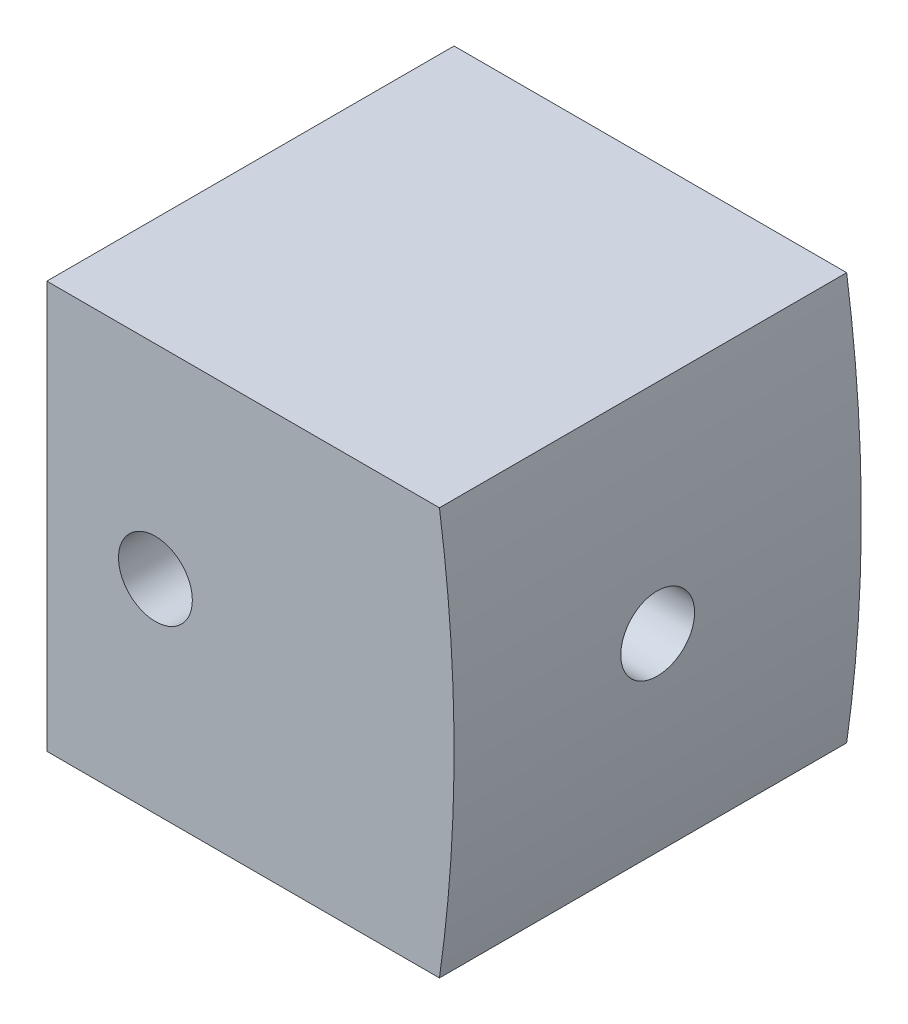
ISO-10303-21;
HEADER;
FILE_DESCRIPTION(('STEP AP214'),'2;1');
FILE_NAME('part.step','',(''),(''),'','','');
FILE_SCHEMA(('AUTOMOTIVE_DESIGN { 1 0 10303 214 1 1 1 1 }'));
ENDSEC;
DATA;
#1=APPLICATION_CONTEXT('core data for automotive mechanical design processes');
#2=APPLICATION_PROTOCOL_DEFINITION('international standard','automotive_design',2000,#1);
#3=PRODUCT_CONTEXT('',#1,'mechanical');
#4=PRODUCT('Part','Part','',(#3));
#5=PRODUCT_RELATED_PRODUCT_CATEGORY('part','',(#4));
#6=PRODUCT_DEFINITION_FORMATION('','',#4);
#7=PRODUCT_DEFINITION_CONTEXT('part definition',#1,'design');
#8=PRODUCT_DEFINITION('design','',#6,#7);
#9=PRODUCT_DEFINITION_SHAPE('','',#8);
#10=(LENGTH_UNIT() NAMED_UNIT(*) SI_UNIT(.MILLI.,.METRE.));
#11=(NAMED_UNIT(*) PLANE_ANGLE_UNIT() SI_UNIT($,.RADIAN.));
#12=(NAMED_UNIT(*) SI_UNIT($,.STERADIAN.) SOLID_ANGLE_UNIT());
#13=UNCERTAINTY_MEASURE_WITH_UNIT(LENGTH_MEASURE(1.E-05),#10,'distance_accuracy_value','');
#14=(GEOMETRIC_REPRESENTATION_CONTEXT(3) GLOBAL_UNCERTAINTY_ASSIGNED_CONTEXT((#13)) GLOBAL_UNIT_ASSIGNED_CONTEXT((#10,
#11,#12)) REPRESENTATION_CONTEXT('',''));
#15=CARTESIAN_POINT('',(0.,0.,0.));
#16=DIRECTION('',(0.,0.,1.));
#17=DIRECTION('',(1.,0.,0.));
#18=AXIS2_PLACEMENT_3D('',#15,#16,#17);
#19=CARTESIAN_POINT('',(-9.525,0.,9.525));
#20=DIRECTION('',(-1.,0.,0.));
#21=DIRECTION('',(0.,0.,1.));
#22=AXIS2_PLACEMENT_3D('',#19,#20,#21);
#23=CYLINDRICAL_SURFACE('',#22,1.72719999999999);
#24=CARTESIAN_POINT('',(-9.525,0.,9.525));
#25=DIRECTION('',(-1.,0.,0.));
#26=DIRECTION('',(0.,0.,1.));
#27=AXIS2_PLACEMENT_3D('',#24,#25,#26);
#28=CIRCLE('',#27,1.72719999999999);
#29=CARTESIAN_POINT('',(-9.525,0.,11.2522));
#30=VERTEX_POINT('',#29);
#31=EDGE_CURVE('E170',#30,#30,#28,.T.);
#32=ORIENTED_EDGE('',*,*,#31,.T.);
#33=EDGE_LOOP('',(#32));
#34=FACE_BOUND('',#33,.T.);
#35=CARTESIAN_POINT('',(-4.445,0.,9.525));
#36=DIRECTION('',(-0.707106781186547,0.,-0.707106781186547));
#37=DIRECTION('',(-0.707106781186547,0.,0.707106781186547));
#38=AXIS2_PLACEMENT_3D('',#35,#36,#37);
#39=ELLIPSE('',#38,2.4426296649308,1.72719999999999);
#40=CARTESIAN_POINT('',(-4.445,1.72719999999999,9.525));
#41=VERTEX_POINT('',#40);
#42=CARTESIAN_POINT('',(-4.445,-1.72719999999999,9.525));
#43=VERTEX_POINT('',#42);
#44=EDGE_CURVE('E44',#41,#43,#39,.F.);
#45=ORIENTED_EDGE('',*,*,#44,.T.);
#46=CARTESIAN_POINT('',(-4.445,0.,9.525));
#47=DIRECTION('',(-0.707106781186547,0.,0.707106781186547));
#48=DIRECTION('',(-0.707106781186547,0.,-0.707106781186547));
#49=AXIS2_PLACEMENT_3D('',#46,#47,#48);
#50=ELLIPSE('',#49,2.4426296649308,1.72719999999999);
#51=EDGE_CURVE('E11',#43,#41,#50,.F.);
#52=ORIENTED_EDGE('',*,*,#51,.T.);
#53=EDGE_LOOP('',(#45,#52));
#54=FACE_BOUND('',#53,.T.);
#55=ADVANCED_FACE('F31',(#34,#54),#23,.F.);
#56=CARTESIAN_POINT('',(-57.15,0.,84.1069598552339));
#57=DIRECTION('',(0.,0.,-1.));
#58=DIRECTION('',(-1.,0.,0.));
#59=AXIS2_PLACEMENT_3D('',#56,#57,#58);
#60=CYLINDRICAL_SURFACE('',#59,66.675);
#61=CARTESIAN_POINT('',(9.525,0.,7.79780000000001));
#62=CARTESIAN_POINT('',(9.5249997271463,-0.096919026527518,7.79780401584252));
#63=CARTESIAN_POINT('',(9.52478626524063,-0.193969002963632,7.80599089557251));
#64=CARTESIAN_POINT('',(9.52395488633022,-0.38545609424327,7.83855083494033));
#65=CARTESIAN_POINT('',(9.52333610470426,-0.479887172625967,7.86295849810765));
#66=CARTESIAN_POINT('',(9.52176410965185,-0.663243979803649,7.9272668859244));
#67=CARTESIAN_POINT('',(9.52081117860507,-0.752174282722503,7.96715453193407));
#68=CARTESIAN_POINT('',(9.51867863219222,-0.922029105703944,8.06126932741671));
#69=CARTESIAN_POINT('',(9.51749912369497,-1.00295737290155,8.11548972114059));
#70=CARTESIAN_POINT('',(9.51504547340202,-1.15459941018497,8.23676527820526));
#71=CARTESIAN_POINT('',(9.5137712936209,-1.22530904632216,8.30382561058093));
#72=CARTESIAN_POINT('',(9.51127219994384,-1.35447339710308,8.44887120857517));
#73=CARTESIAN_POINT('',(9.5100472903271,-1.41292704913954,8.52685742050244));
#74=CARTESIAN_POINT('',(9.50778483740791,-1.51591858749009,8.69154693720306));
#75=CARTESIAN_POINT('',(9.50674731339763,-1.56045504131022,8.77825113810374));
#76=CARTESIAN_POINT('',(9.50497684406234,-1.63433793709756,8.95790823795522));
#77=CARTESIAN_POINT('',(9.50424389502836,-1.6636845640409,9.05086106079702));
#78=CARTESIAN_POINT('',(9.50316539896893,-1.70634916287136,9.24035567637849));
#79=CARTESIAN_POINT('',(9.50281976593061,-1.71967069356651,9.33689666735668));
#80=CARTESIAN_POINT('',(9.50255461410864,-1.72991789260032,9.53084542146387));
#81=CARTESIAN_POINT('',(9.50263509462856,-1.72684358773523,9.62825318317603));
#82=CARTESIAN_POINT('',(9.50321301298442,-1.70438947216201,9.82114517588286));
#83=CARTESIAN_POINT('',(9.50371034837884,-1.68501366752044,9.91662987356476));
#84=CARTESIAN_POINT('',(9.50506575691723,-1.63051243227466,10.1029917235434));
#85=CARTESIAN_POINT('',(9.50592383420965,-1.59538682055032,10.1938688228401));
#86=CARTESIAN_POINT('',(9.50790414644867,-1.51037703728569,10.3684506604803));
#87=CARTESIAN_POINT('',(9.50902642353302,-1.46049051117104,10.4521542517986));
#88=CARTESIAN_POINT('',(9.51140845283288,-1.34738135119607,10.6099926028409));
#89=CARTESIAN_POINT('',(9.51266819350677,-1.28415983654347,10.6841281647698));
#90=CARTESIAN_POINT('',(9.5151834290075,-1.14616559902246,10.8207440595046));
#91=CARTESIAN_POINT('',(9.51643892339445,-1.07139171473136,10.883223219033));
#92=CARTESIAN_POINT('',(9.51880463928992,-0.91237340947304,10.9947717052161));
#93=CARTESIAN_POINT('',(9.51991479187773,-0.828124530436558,11.0438346818698));
#94=CARTESIAN_POINT('',(9.52186476132179,-0.6525258640606,11.1271513462516));
#95=CARTESIAN_POINT('',(9.52270435036638,-0.561170172776067,11.1613925624937));
#96=CARTESIAN_POINT('',(9.5240155620405,-0.374131258654292,11.2139781989615));
#97=CARTESIAN_POINT('',(9.52448796743231,-0.278457704218404,11.2323564451719));
#98=CARTESIAN_POINT('',(9.52483410453939,-0.151813653192035,11.2457851059836));
#99=CARTESIAN_POINT('',(9.52489619656248,-0.12150426125484,11.2481890068486));
#100=CARTESIAN_POINT('',(9.52497918709485,-0.0608008759945975,11.2513970838197));
#101=CARTESIAN_POINT('',(9.52500008560374,-0.030406882670709,11.25220125991));
#102=CARTESIAN_POINT('',(9.52499972714631,0.0969190265275162,11.2521959841575));
#103=CARTESIAN_POINT('',(9.52478626524063,0.19396900296363,11.2440091044275));
#104=CARTESIAN_POINT('',(9.52395488633022,0.385456094243269,11.2114491650597));
#105=CARTESIAN_POINT('',(9.52333610470426,0.479887172625966,11.1870415018924));
#106=CARTESIAN_POINT('',(9.52176410965185,0.66324397980365,11.1227331140756));
#107=CARTESIAN_POINT('',(9.52081117860506,0.752174282722503,11.0828454680659));
#108=CARTESIAN_POINT('',(9.51867863219221,0.922029105703945,10.9887306725833));
#109=CARTESIAN_POINT('',(9.51749912369497,1.00295737290155,10.9345102788594));
#110=CARTESIAN_POINT('',(9.51504547340202,1.15459941018497,10.8132347217947));
#111=CARTESIAN_POINT('',(9.51377129362089,1.22530904632216,10.7461743894191));
#112=CARTESIAN_POINT('',(9.51127219994383,1.35447339710308,10.6011287914248));
#113=CARTESIAN_POINT('',(9.5100472903271,1.41292704913954,10.5231425794976));
#114=CARTESIAN_POINT('',(9.50778483740791,1.51591858749009,10.358453062797));
#115=CARTESIAN_POINT('',(9.50674731339763,1.56045504131022,10.2717488618963));
#116=CARTESIAN_POINT('',(9.50497684406235,1.63433793709756,10.0920917620448));
#117=CARTESIAN_POINT('',(9.50424389502836,1.6636845640409,9.99913893920298));
#118=CARTESIAN_POINT('',(9.50316539896893,1.70634916287136,9.80964432362152));
#119=CARTESIAN_POINT('',(9.50281976593061,1.71967069356651,9.71310333264333));
#120=CARTESIAN_POINT('',(9.50255461410863,1.72991789260032,9.51915457853613));
#121=CARTESIAN_POINT('',(9.50263509462856,1.72684358773523,9.42174681682398));
#122=CARTESIAN_POINT('',(9.50321301298442,1.70438947216201,9.22885482411714));
#123=CARTESIAN_POINT('',(9.50371034837884,1.68501366752044,9.13337012643525));
#124=CARTESIAN_POINT('',(9.50506575691723,1.63051243227466,8.94700827645663));
#125=CARTESIAN_POINT('',(9.50592383420965,1.59538682055032,8.85613117715989));
#126=CARTESIAN_POINT('',(9.50790414644867,1.51037703728568,8.68154933951973));
#127=CARTESIAN_POINT('',(9.50902642353303,1.46049051117103,8.59784574820137));
#128=CARTESIAN_POINT('',(9.51140845283289,1.34738135119607,8.44000739715914));
#129=CARTESIAN_POINT('',(9.51266819350677,1.28415983654347,8.36587183523019));
#130=CARTESIAN_POINT('',(9.5151834290075,1.14616559902246,8.22925594049541));
#131=CARTESIAN_POINT('',(9.51643892339446,1.07139171473135,8.16677678096699));
#132=CARTESIAN_POINT('',(9.51880463928992,0.912373409473034,8.05522829478391));
#133=CARTESIAN_POINT('',(9.51991479187772,0.828124530436552,8.00616531813018));
#134=CARTESIAN_POINT('',(9.52186476132178,0.652525864060593,7.92284865374844));
#135=CARTESIAN_POINT('',(9.52270435036636,0.561170172776059,7.88860743750635));
#136=CARTESIAN_POINT('',(9.5240155620405,0.374131258654284,7.83602180103849));
#137=CARTESIAN_POINT('',(9.52448796743231,0.278457704218396,7.81764355482807));
#138=CARTESIAN_POINT('',(9.52483410453939,0.151813653192028,7.80421489401642));
#139=CARTESIAN_POINT('',(9.52489619656247,0.121504261254833,7.80181099315143));
#140=CARTESIAN_POINT('',(9.52497918709485,0.0608008759945933,7.79860291618026));
#141=CARTESIAN_POINT('',(9.52500008560373,0.0304068826707059,7.79779874009));
#142=CARTESIAN_POINT('',(9.525,0.,7.79780000000001));
#143=B_SPLINE_CURVE_WITH_KNOTS('',3,(#61,#62,#63,#64,#65,#66,#67,#68,#69,#70,#71,#72,#73,#74,
#75,#76,#77,#78,#79,#80,#81,#82,#83,#84,#85,#86,#87,#88,#89,#90,#91,#92,#93,#94,#95,#96,#97,#98,
#99,#100,#101,#102,#103,#104,#105,#106,#107,#108,#109,#110,#111,#112,#113,#114,#115,#116,#117,
#118,#119,#120,#121,#122,#123,#124,#125,#126,#127,#128,#129,#130,#131,#132,#133,#134,#135,#136,
#137,#138,#139,#140,#141,#142),.UNSPECIFIED.,.T.,.F.,(4,2,2,2,2,2,2,2,2,2,2,2,2,2,2,2,2,2,2,2,2,
2,2,2,2,2,2,2,2,2,2,2,2,2,2,2,2,2,2,2,4),(0.,0.290641425486586,0.581904870359256,
0.872922768079454,1.16380373817944,1.4548020567626,1.7458255947962,2.03687907795566,
2.32792901668943,2.61891430793689,2.90989912361762,3.20081245114229,3.49172912420721,
3.78269222763107,4.07363092018563,4.36459888144921,4.65570432304464,4.94705423582523,
5.23778133215426,5.32896569453136,5.42015005781537,5.71079148330196,6.00205492817463,
6.29307282589483,6.58395379599481,6.87495211457798,7.16597565261158,7.45702913577103,
7.7480790745048,8.03906436575227,8.33004918143299,8.62096250895767,8.91187918202258,
9.20284228544644,9.493780978001,9.78474893926458,10.07585438086,10.3672042936406,
10.6579313899696,10.7491157523467,10.8403001156307),.UNSPECIFIED.);
#144=CARTESIAN_POINT('',(9.525,0.,7.79780000000001));
#145=VERTEX_POINT('',#144);
#146=EDGE_CURVE('E86',#145,#145,#143,.T.);
#147=ORIENTED_EDGE('',*,*,#146,.T.);
#148=EDGE_LOOP('',(#147));
#149=FACE_BOUND('',#148,.T.);
#150=DIRECTION('',(0.,0.,-1.));
#151=VECTOR('',#150,1.);
#152=CARTESIAN_POINT('',(8.84113576837422,9.525,84.1069598552339));
#153=LINE('',#152,#151);
#154=CARTESIAN_POINT('',(8.84113576837422,9.525,19.05));
#155=VERTEX_POINT('',#154);
#156=CARTESIAN_POINT('',(8.84113576837422,9.525,0.));
#157=VERTEX_POINT('',#156);
#158=EDGE_CURVE('E151',#155,#157,#153,.T.);
#159=ORIENTED_EDGE('',*,*,#158,.F.);
#160=CARTESIAN_POINT('',(-57.15,0.,19.05));
#161=DIRECTION('',(0.,0.,-1.));
#162=DIRECTION('',(-1.,0.,0.));
#163=AXIS2_PLACEMENT_3D('',#160,#161,#162);
#164=CIRCLE('',#163,66.675);
#165=CARTESIAN_POINT('',(8.84113576837423,-9.52499999999997,19.05));
#166=VERTEX_POINT('',#165);
#167=EDGE_CURVE('E156',#155,#166,#164,.T.);
#168=ORIENTED_EDGE('',*,*,#167,.T.);
#169=DIRECTION('',(0.,0.,-1.));
#170=VECTOR('',#169,1.);
#171=CARTESIAN_POINT('',(8.84113576837423,-9.52499999999997,84.1069598552339));
#172=LINE('',#171,#170);
#173=CARTESIAN_POINT('',(8.84113576837423,-9.525,0.));
#174=VERTEX_POINT('',#173);
#175=EDGE_CURVE('E145',#166,#174,#172,.T.);
#176=ORIENTED_EDGE('',*,*,#175,.T.);
#177=CARTESIAN_POINT('',(-57.15,0.,0.));
#178=DIRECTION('',(0.,0.,-1.));
#179=DIRECTION('',(-1.,0.,0.));
#180=AXIS2_PLACEMENT_3D('',#177,#178,#179);
#181=CIRCLE('',#180,66.675);
#182=EDGE_CURVE('E52',#157,#174,#181,.T.);
#183=ORIENTED_EDGE('',*,*,#182,.F.);
#184=EDGE_LOOP('',(#159,#168,#176,#183));
#185=FACE_BOUND('',#184,.T.);
#186=ADVANCED_FACE('F101',(#149,#185),#60,.T.);
#187=CARTESIAN_POINT('',(-9.525,9.525,19.05));
#188=DIRECTION('',(0.,-1.,0.));
#189=DIRECTION('',(0.,0.,-1.));
#190=AXIS2_PLACEMENT_3D('',#187,#188,#189);
#191=PLANE('',#190);
#192=ORIENTED_EDGE('',*,*,#158,.T.);
#193=DIRECTION('',(-1.,0.,0.));
#194=VECTOR('',#193,1.);
#195=CARTESIAN_POINT('',(-9.525,9.525,0.));
#196=LINE('',#195,#194);
#197=CARTESIAN_POINT('',(-9.525,9.525,0.));
#198=VERTEX_POINT('',#197);
#199=EDGE_CURVE('E167',#157,#198,#196,.T.);
#200=ORIENTED_EDGE('',*,*,#199,.T.);
#201=DIRECTION('',(0.,0.,-1.));
#202=VECTOR('',#201,1.);
#203=CARTESIAN_POINT('',(-9.525,9.525,19.05));
#204=LINE('',#203,#202);
#205=CARTESIAN_POINT('',(-9.525,9.525,19.05));
#206=VERTEX_POINT('',#205);
#207=EDGE_CURVE('E97',#206,#198,#204,.T.);
#208=ORIENTED_EDGE('',*,*,#207,.F.);
#209=DIRECTION('',(-1.,0.,0.));
#210=VECTOR('',#209,1.);
#211=CARTESIAN_POINT('',(-9.525,9.525,19.05));
#212=LINE('',#211,#210);
#213=EDGE_CURVE('E163',#155,#206,#212,.T.);
#214=ORIENTED_EDGE('',*,*,#213,.F.);
#215=EDGE_LOOP('',(#192,#200,#208,#214));
#216=FACE_BOUND('',#215,.T.);
#217=ADVANCED_FACE('F33',(#216),#191,.F.);
#218=CARTESIAN_POINT('',(-9.525,-9.525,19.05));
#219=DIRECTION('',(0.,1.,0.));
#220=DIRECTION('',(0.,0.,1.));
#221=AXIS2_PLACEMENT_3D('',#218,#219,#220);
#222=PLANE('',#221);
#223=ORIENTED_EDGE('',*,*,#175,.F.);
#224=DIRECTION('',(1.,0.,0.));
#225=VECTOR('',#224,1.);
#226=CARTESIAN_POINT('',(-9.525,-9.525,19.05));
#227=LINE('',#226,#225);
#228=CARTESIAN_POINT('',(-9.525,-9.525,19.05));
#229=VERTEX_POINT('',#228);
#230=EDGE_CURVE('E148',#229,#166,#227,.T.);
#231=ORIENTED_EDGE('',*,*,#230,.F.);
#232=DIRECTION('',(0.,0.,-1.));
#233=VECTOR('',#232,1.);
#234=CARTESIAN_POINT('',(-9.525,-9.525,19.05));
#235=LINE('',#234,#233);
#236=CARTESIAN_POINT('',(-9.525,-9.525,0.));
#237=VERTEX_POINT('',#236);
#238=EDGE_CURVE('E161',#229,#237,#235,.T.);
#239=ORIENTED_EDGE('',*,*,#238,.T.);
#240=DIRECTION('',(1.,0.,0.));
#241=VECTOR('',#240,1.);
#242=CARTESIAN_POINT('',(-9.525,-9.525,0.));
#243=LINE('',#242,#241);
#244=EDGE_CURVE('E149',#237,#174,#243,.T.);
#245=ORIENTED_EDGE('',*,*,#244,.T.);
#246=EDGE_LOOP('',(#223,#231,#239,#245));
#247=FACE_BOUND('',#246,.T.);
#248=ADVANCED_FACE('F132',(#247),#222,.F.);
#249=CARTESIAN_POINT('',(9.525,9.525,19.05));
#250=DIRECTION('',(0.,0.,-1.));
#251=DIRECTION('',(-1.,0.,0.));
#252=AXIS2_PLACEMENT_3D('',#249,#250,#251);
#253=PLANE('',#252);
#254=CARTESIAN_POINT('',(-4.445,0.,19.05));
#255=DIRECTION('',(0.,0.,1.));
#256=DIRECTION('',(1.,0.,0.));
#257=AXIS2_PLACEMENT_3D('',#254,#255,#256);
#258=CIRCLE('',#257,1.72719999999999);
#259=CARTESIAN_POINT('',(-2.71780000000001,0.,19.05));
#260=VERTEX_POINT('',#259);
#261=EDGE_CURVE('E180',#260,#260,#258,.T.);
#262=ORIENTED_EDGE('',*,*,#261,.F.);
#263=EDGE_LOOP('',(#262));
#264=FACE_BOUND('',#263,.T.);
#265=ORIENTED_EDGE('',*,*,#167,.F.);
#266=ORIENTED_EDGE('',*,*,#213,.T.);
#267=DIRECTION('',(0.,-1.,0.));
#268=VECTOR('',#267,1.);
#269=CARTESIAN_POINT('',(-9.525,-9.525,19.05));
#270=LINE('',#269,#268);
#271=EDGE_CURVE('E159',#206,#229,#270,.T.);
#272=ORIENTED_EDGE('',*,*,#271,.T.);
#273=ORIENTED_EDGE('',*,*,#230,.T.);
#274=EDGE_LOOP('',(#265,#266,#272,#273));
#275=FACE_BOUND('',#274,.T.);
#276=ADVANCED_FACE('F126',(#264,#275),#253,.F.);
#277=CARTESIAN_POINT('',(9.525,9.525,0.));
#278=DIRECTION('',(0.,0.,-1.));
#279=DIRECTION('',(-1.,0.,0.));
#280=AXIS2_PLACEMENT_3D('',#277,#278,#279);
#281=PLANE('',#280);
#282=CARTESIAN_POINT('',(-4.445,0.,0.));
#283=DIRECTION('',(0.,0.,1.));
#284=DIRECTION('',(1.,0.,0.));
#285=AXIS2_PLACEMENT_3D('',#282,#283,#284);
#286=CIRCLE('',#285,1.7272);
#287=CARTESIAN_POINT('',(-2.7178,0.,0.));
#288=VERTEX_POINT('',#287);
#289=EDGE_CURVE('E152',#288,#288,#286,.T.);
#290=ORIENTED_EDGE('',*,*,#289,.T.);
#291=EDGE_LOOP('',(#290));
#292=FACE_BOUND('',#291,.T.);
#293=ORIENTED_EDGE('',*,*,#199,.F.);
#294=ORIENTED_EDGE('',*,*,#182,.T.);
#295=ORIENTED_EDGE('',*,*,#244,.F.);
#296=DIRECTION('',(0.,-1.,0.));
#297=VECTOR('',#296,1.);
#298=CARTESIAN_POINT('',(-9.525,-9.525,0.));
#299=LINE('',#298,#297);
#300=EDGE_CURVE('E169',#198,#237,#299,.T.);
#301=ORIENTED_EDGE('',*,*,#300,.F.);
#302=EDGE_LOOP('',(#293,#294,#295,#301));
#303=FACE_BOUND('',#302,.T.);
#304=ADVANCED_FACE('F120',(#292,#303),#281,.T.);
#305=CARTESIAN_POINT('',(-4.445,0.,9.525));
#306=DIRECTION('',(-0.707106781186547,0.,-0.707106781186547));
#307=DIRECTION('',(-0.707106781186547,0.,0.707106781186547));
#308=AXIS2_PLACEMENT_3D('',#305,#306,#307);
#309=ELLIPSE('',#308,2.4426296649308,1.72719999999999);
#310=EDGE_CURVE('E79',#41,#43,#309,.T.);
#311=ORIENTED_EDGE('',*,*,#310,.T.);
#312=CARTESIAN_POINT('',(-4.445,0.,9.525));
#313=DIRECTION('',(-0.707106781186547,0.,0.707106781186547));
#314=DIRECTION('',(-0.707106781186547,0.,-0.707106781186547));
#315=AXIS2_PLACEMENT_3D('',#312,#313,#314);
#316=ELLIPSE('',#315,2.4426296649308,1.72719999999999);
#317=EDGE_CURVE('E39',#43,#41,#316,.T.);
#318=ORIENTED_EDGE('',*,*,#317,.T.);
#319=EDGE_LOOP('',(#311,#318));
#320=FACE_BOUND('',#319,.T.);
#321=ORIENTED_EDGE('',*,*,#146,.F.);
#322=EDGE_LOOP('',(#321));
#323=FACE_BOUND('',#322,.T.);
#324=ADVANCED_FACE('F88',(#320,#323),#23,.F.);
#325=CARTESIAN_POINT('',(-9.525,-9.525,19.05));
#326=DIRECTION('',(1.,0.,0.));
#327=DIRECTION('',(0.,0.,-1.));
#328=AXIS2_PLACEMENT_3D('',#325,#326,#327);
#329=PLANE('',#328);
#330=ORIENTED_EDGE('',*,*,#31,.F.);
#331=EDGE_LOOP('',(#330));
#332=FACE_BOUND('',#331,.T.);
#333=ORIENTED_EDGE('',*,*,#300,.T.);
#334=ORIENTED_EDGE('',*,*,#238,.F.);
#335=ORIENTED_EDGE('',*,*,#271,.F.);
#336=ORIENTED_EDGE('',*,*,#207,.T.);
#337=EDGE_LOOP('',(#333,#334,#335,#336));
#338=FACE_BOUND('',#337,.T.);
#339=ADVANCED_FACE('F111',(#332,#338),#329,.F.);
#340=CARTESIAN_POINT('',(-4.445,0.,19.05));
#341=DIRECTION('',(0.,0.,1.));
#342=DIRECTION('',(1.,0.,0.));
#343=AXIS2_PLACEMENT_3D('',#340,#341,#342);
#344=CYLINDRICAL_SURFACE('',#343,1.72719999999999);
#345=ORIENTED_EDGE('',*,*,#261,.T.);
#346=EDGE_LOOP('',(#345));
#347=FACE_BOUND('',#346,.T.);
#348=ORIENTED_EDGE('',*,*,#44,.F.);
#349=ORIENTED_EDGE('',*,*,#317,.F.);
#350=EDGE_LOOP('',(#348,#349));
#351=FACE_BOUND('',#350,.T.);
#352=ADVANCED_FACE('F85',(#347,#351),#344,.F.);
#353=ORIENTED_EDGE('',*,*,#289,.F.);
#354=EDGE_LOOP('',(#353));
#355=FACE_BOUND('',#354,.T.);
#356=ORIENTED_EDGE('',*,*,#310,.F.);
#357=ORIENTED_EDGE('',*,*,#51,.F.);
#358=EDGE_LOOP('',(#356,#357));
#359=FACE_BOUND('',#358,.T.);
#360=ADVANCED_FACE('F80',(#355,#359),#344,.F.);
#361=CLOSED_SHELL('',(#55,#186,#217,#248,#276,#304,#324,#339,#352,#360));
#362=MANIFOLD_SOLID_BREP('B2',#361);
#363=ADVANCED_BREP_SHAPE_REPRESENTATION('',(#18,#362),#14);
#364=SHAPE_DEFINITION_REPRESENTATION(#9,#363);
ENDSEC;
END-ISO-10303-21;
